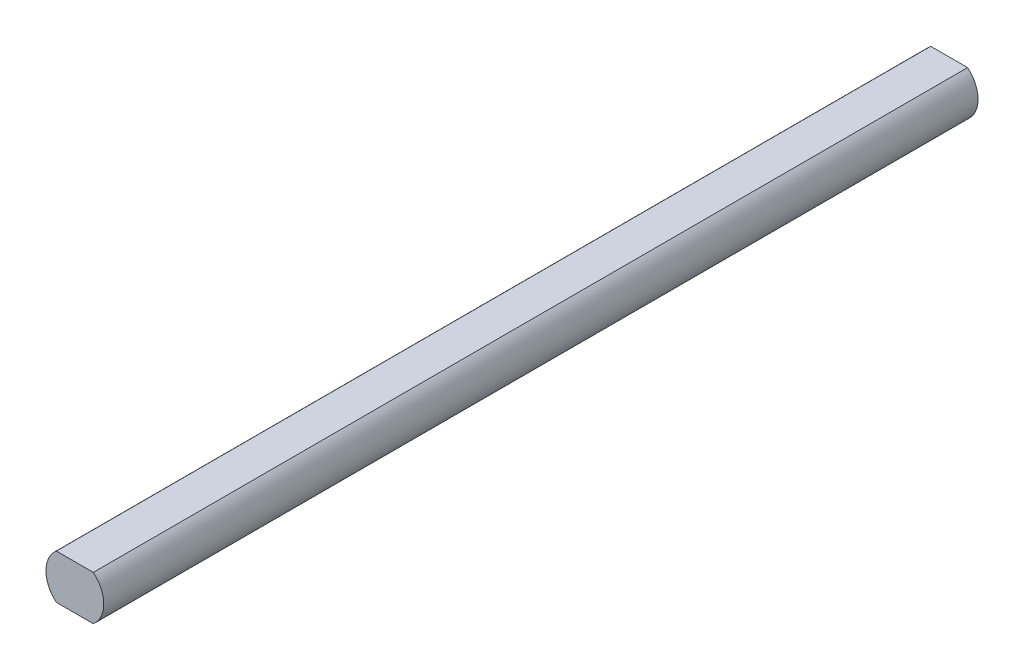
ISO-10303-21;
HEADER;
FILE_DESCRIPTION(('STEP AP214'),'2;1');
FILE_NAME('part.step','',(''),(''),'','','');
FILE_SCHEMA(('AUTOMOTIVE_DESIGN { 1 0 10303 214 1 1 1 1 }'));
ENDSEC;
DATA;
#1=APPLICATION_CONTEXT('core data for automotive mechanical design processes');
#2=APPLICATION_PROTOCOL_DEFINITION('international standard','automotive_design',2000,#1);
#3=PRODUCT_CONTEXT('',#1,'mechanical');
#4=PRODUCT('Part','Part','',(#3));
#5=PRODUCT_RELATED_PRODUCT_CATEGORY('part','',(#4));
#6=PRODUCT_DEFINITION_FORMATION('','',#4);
#7=PRODUCT_DEFINITION_CONTEXT('part definition',#1,'design');
#8=PRODUCT_DEFINITION('design','',#6,#7);
#9=PRODUCT_DEFINITION_SHAPE('','',#8);
#10=(LENGTH_UNIT() NAMED_UNIT(*) SI_UNIT(.MILLI.,.METRE.));
#11=(NAMED_UNIT(*) PLANE_ANGLE_UNIT() SI_UNIT($,.RADIAN.));
#12=(NAMED_UNIT(*) SI_UNIT($,.STERADIAN.) SOLID_ANGLE_UNIT());
#13=UNCERTAINTY_MEASURE_WITH_UNIT(LENGTH_MEASURE(1.E-05),#10,'distance_accuracy_value','');
#14=(GEOMETRIC_REPRESENTATION_CONTEXT(3) GLOBAL_UNCERTAINTY_ASSIGNED_CONTEXT((#13)) GLOBAL_UNIT_ASSIGNED_CONTEXT((#10,
#11,#12)) REPRESENTATION_CONTEXT('',''));
#15=CARTESIAN_POINT('',(0.,0.,0.));
#16=DIRECTION('',(0.,0.,1.));
#17=DIRECTION('',(1.,0.,0.));
#18=AXIS2_PLACEMENT_3D('',#15,#16,#17);
#19=CARTESIAN_POINT('',(0.,0.,118.));
#20=DIRECTION('',(0.,0.,-1.));
#21=DIRECTION('',(-1.,0.,0.));
#22=AXIS2_PLACEMENT_3D('',#19,#20,#21);
#23=CYLINDRICAL_SURFACE('',#22,3.9);
#24=CARTESIAN_POINT('',(0.,0.,0.));
#25=DIRECTION('',(0.,0.,1.));
#26=DIRECTION('',(1.,0.,0.));
#27=AXIS2_PLACEMENT_3D('',#24,#25,#26);
#28=CIRCLE('',#27,3.9);
#29=CARTESIAN_POINT('',(-2.49198715887542,3.,0.));
#30=VERTEX_POINT('',#29);
#31=CARTESIAN_POINT('',(-2.49198715887542,-3.,0.));
#32=VERTEX_POINT('',#31);
#33=EDGE_CURVE('E95',#30,#32,#28,.T.);
#34=ORIENTED_EDGE('',*,*,#33,.T.);
#35=DIRECTION('',(0.,0.,-1.));
#36=VECTOR('',#35,1.);
#37=CARTESIAN_POINT('',(-2.49198715887542,-3.,118.));
#38=LINE('',#37,#36);
#39=CARTESIAN_POINT('',(-2.49198715887542,-3.,118.));
#40=VERTEX_POINT('',#39);
#41=EDGE_CURVE('E11',#40,#32,#38,.T.);
#42=ORIENTED_EDGE('',*,*,#41,.F.);
#43=CARTESIAN_POINT('',(0.,0.,118.));
#44=DIRECTION('',(0.,0.,1.));
#45=DIRECTION('',(1.,0.,0.));
#46=AXIS2_PLACEMENT_3D('',#43,#44,#45);
#47=CIRCLE('',#46,3.9);
#48=CARTESIAN_POINT('',(-2.49198715887542,3.,118.));
#49=VERTEX_POINT('',#48);
#50=EDGE_CURVE('E83',#49,#40,#47,.T.);
#51=ORIENTED_EDGE('',*,*,#50,.F.);
#52=DIRECTION('',(0.,0.,-1.));
#53=VECTOR('',#52,1.);
#54=CARTESIAN_POINT('',(-2.49198715887542,3.,118.));
#55=LINE('',#54,#53);
#56=EDGE_CURVE('E91',#49,#30,#55,.T.);
#57=ORIENTED_EDGE('',*,*,#56,.T.);
#58=EDGE_LOOP('',(#34,#42,#51,#57));
#59=FACE_BOUND('',#58,.T.);
#60=ADVANCED_FACE('F32',(#59),#23,.T.);
#61=CARTESIAN_POINT('',(2.49198715887542,-3.,118.));
#62=DIRECTION('',(0.,1.,0.));
#63=DIRECTION('',(0.,0.,1.));
#64=AXIS2_PLACEMENT_3D('',#61,#62,#63);
#65=PLANE('',#64);
#66=DIRECTION('',(1.,0.,0.));
#67=VECTOR('',#66,1.);
#68=CARTESIAN_POINT('',(2.49198715887542,-3.,0.));
#69=LINE('',#68,#67);
#70=CARTESIAN_POINT('',(2.49198715887542,-3.,0.));
#71=VERTEX_POINT('',#70);
#72=EDGE_CURVE('E87',#32,#71,#69,.T.);
#73=ORIENTED_EDGE('',*,*,#72,.T.);
#74=DIRECTION('',(0.,0.,-1.));
#75=VECTOR('',#74,1.);
#76=CARTESIAN_POINT('',(2.49198715887542,-3.,118.));
#77=LINE('',#76,#75);
#78=CARTESIAN_POINT('',(2.49198715887542,-3.,118.));
#79=VERTEX_POINT('',#78);
#80=EDGE_CURVE('E40',#79,#71,#77,.T.);
#81=ORIENTED_EDGE('',*,*,#80,.F.);
#82=DIRECTION('',(1.,0.,0.));
#83=VECTOR('',#82,1.);
#84=CARTESIAN_POINT('',(2.49198715887542,-3.,118.));
#85=LINE('',#84,#83);
#86=EDGE_CURVE('E78',#40,#79,#85,.T.);
#87=ORIENTED_EDGE('',*,*,#86,.F.);
#88=ORIENTED_EDGE('',*,*,#41,.T.);
#89=EDGE_LOOP('',(#73,#81,#87,#88));
#90=FACE_BOUND('',#89,.T.);
#91=ADVANCED_FACE('F86',(#90),#65,.F.);
#92=CARTESIAN_POINT('',(0.,0.,118.));
#93=DIRECTION('',(0.,0.,-1.));
#94=DIRECTION('',(-1.,0.,0.));
#95=AXIS2_PLACEMENT_3D('',#92,#93,#94);
#96=CYLINDRICAL_SURFACE('',#95,3.9);
#97=CARTESIAN_POINT('',(0.,0.,0.));
#98=DIRECTION('',(0.,0.,1.));
#99=DIRECTION('',(1.,0.,0.));
#100=AXIS2_PLACEMENT_3D('',#97,#98,#99);
#101=CIRCLE('',#100,3.9);
#102=CARTESIAN_POINT('',(2.49198715887542,3.,0.));
#103=VERTEX_POINT('',#102);
#104=EDGE_CURVE('E65',#71,#103,#101,.T.);
#105=ORIENTED_EDGE('',*,*,#104,.T.);
#106=DIRECTION('',(0.,0.,-1.));
#107=VECTOR('',#106,1.);
#108=CARTESIAN_POINT('',(2.49198715887542,3.,118.));
#109=LINE('',#108,#107);
#110=CARTESIAN_POINT('',(2.49198715887542,3.,118.));
#111=VERTEX_POINT('',#110);
#112=EDGE_CURVE('E88',#111,#103,#109,.T.);
#113=ORIENTED_EDGE('',*,*,#112,.F.);
#114=CARTESIAN_POINT('',(0.,0.,118.));
#115=DIRECTION('',(0.,0.,1.));
#116=DIRECTION('',(1.,0.,0.));
#117=AXIS2_PLACEMENT_3D('',#114,#115,#116);
#118=CIRCLE('',#117,3.9);
#119=EDGE_CURVE('E81',#79,#111,#118,.T.);
#120=ORIENTED_EDGE('',*,*,#119,.F.);
#121=ORIENTED_EDGE('',*,*,#80,.T.);
#122=EDGE_LOOP('',(#105,#113,#120,#121));
#123=FACE_BOUND('',#122,.T.);
#124=ADVANCED_FACE('F89',(#123),#96,.T.);
#125=CARTESIAN_POINT('',(-2.49198715887542,3.,118.));
#126=DIRECTION('',(0.,-1.,0.));
#127=DIRECTION('',(0.,0.,-1.));
#128=AXIS2_PLACEMENT_3D('',#125,#126,#127);
#129=PLANE('',#128);
#130=DIRECTION('',(-1.,0.,0.));
#131=VECTOR('',#130,1.);
#132=CARTESIAN_POINT('',(-2.49198715887542,3.,0.));
#133=LINE('',#132,#131);
#134=EDGE_CURVE('E71',#103,#30,#133,.T.);
#135=ORIENTED_EDGE('',*,*,#134,.T.);
#136=ORIENTED_EDGE('',*,*,#56,.F.);
#137=DIRECTION('',(-1.,0.,0.));
#138=VECTOR('',#137,1.);
#139=CARTESIAN_POINT('',(-2.49198715887542,3.,118.));
#140=LINE('',#139,#138);
#141=EDGE_CURVE('E48',#111,#49,#140,.T.);
#142=ORIENTED_EDGE('',*,*,#141,.F.);
#143=ORIENTED_EDGE('',*,*,#112,.T.);
#144=EDGE_LOOP('',(#135,#136,#142,#143));
#145=FACE_BOUND('',#144,.T.);
#146=ADVANCED_FACE('F102',(#145),#129,.F.);
#147=CARTESIAN_POINT('',(0.,0.,118.));
#148=DIRECTION('',(0.,0.,1.));
#149=DIRECTION('',(1.,0.,0.));
#150=AXIS2_PLACEMENT_3D('',#147,#148,#149);
#151=PLANE('',#150);
#152=ORIENTED_EDGE('',*,*,#50,.T.);
#153=ORIENTED_EDGE('',*,*,#86,.T.);
#154=ORIENTED_EDGE('',*,*,#119,.T.);
#155=ORIENTED_EDGE('',*,*,#141,.T.);
#156=EDGE_LOOP('',(#152,#153,#154,#155));
#157=FACE_BOUND('',#156,.T.);
#158=ADVANCED_FACE('F79',(#157),#151,.T.);
#159=CARTESIAN_POINT('',(0.,0.,0.));
#160=DIRECTION('',(0.,0.,1.));
#161=DIRECTION('',(1.,0.,0.));
#162=AXIS2_PLACEMENT_3D('',#159,#160,#161);
#163=PLANE('',#162);
#164=ORIENTED_EDGE('',*,*,#33,.F.);
#165=ORIENTED_EDGE('',*,*,#134,.F.);
#166=ORIENTED_EDGE('',*,*,#104,.F.);
#167=ORIENTED_EDGE('',*,*,#72,.F.);
#168=EDGE_LOOP('',(#164,#165,#166,#167));
#169=FACE_BOUND('',#168,.T.);
#170=ADVANCED_FACE('F105',(#169),#163,.F.);
#171=CLOSED_SHELL('',(#60,#91,#124,#146,#158,#170));
#172=MANIFOLD_SOLID_BREP('B2',#171);
#173=ADVANCED_BREP_SHAPE_REPRESENTATION('',(#18,#172),#14);
#174=SHAPE_DEFINITION_REPRESENTATION(#9,#173);
ENDSEC;
END-ISO-10303-21;
